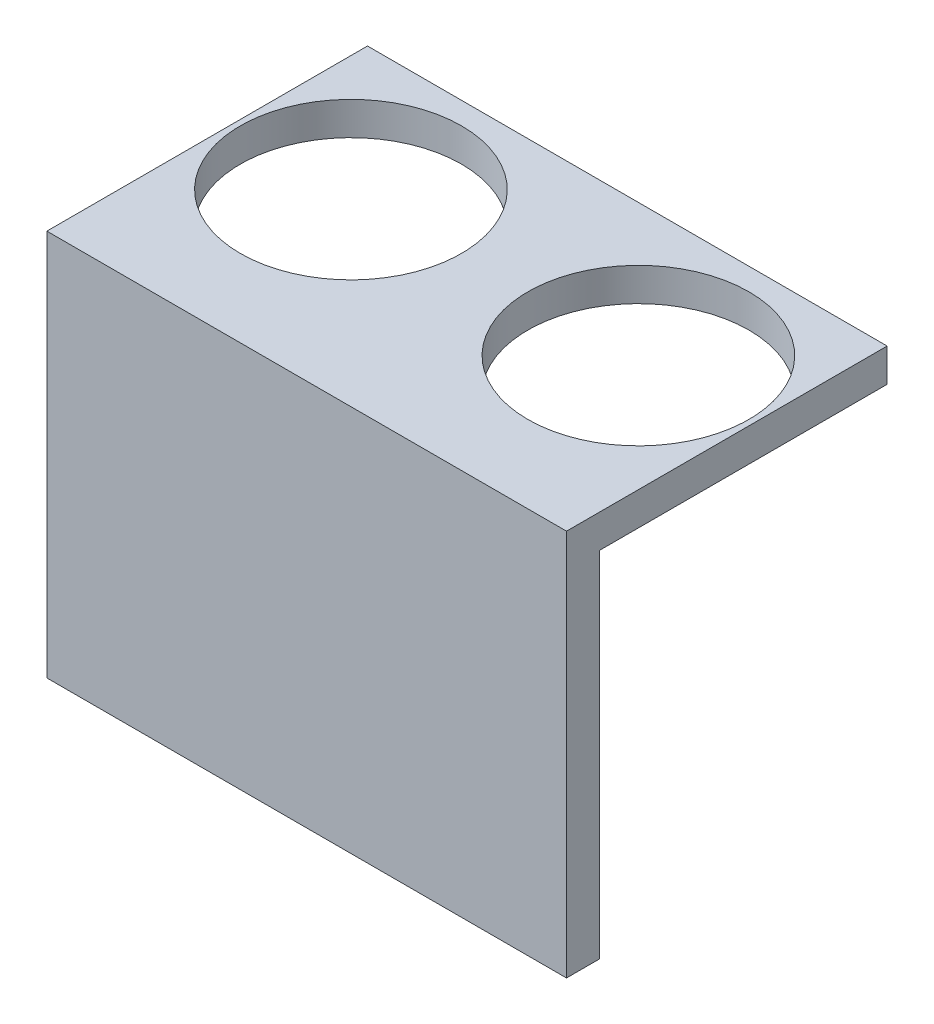
ISO-10303-21;
HEADER;
FILE_DESCRIPTION(('STEP AP214'),'2;1');
FILE_NAME('part.step','',(''),(''),'','','');
FILE_SCHEMA(('AUTOMOTIVE_DESIGN { 1 0 10303 214 1 1 1 1 }'));
ENDSEC;
DATA;
#1=APPLICATION_CONTEXT('core data for automotive mechanical design processes');
#2=APPLICATION_PROTOCOL_DEFINITION('international standard','automotive_design',2000,#1);
#3=PRODUCT_CONTEXT('',#1,'mechanical');
#4=PRODUCT('Part','Part','',(#3));
#5=PRODUCT_RELATED_PRODUCT_CATEGORY('part','',(#4));
#6=PRODUCT_DEFINITION_FORMATION('','',#4);
#7=PRODUCT_DEFINITION_CONTEXT('part definition',#1,'design');
#8=PRODUCT_DEFINITION('design','',#6,#7);
#9=PRODUCT_DEFINITION_SHAPE('','',#8);
#10=(LENGTH_UNIT() NAMED_UNIT(*) SI_UNIT(.MILLI.,.METRE.));
#11=(NAMED_UNIT(*) PLANE_ANGLE_UNIT() SI_UNIT($,.RADIAN.));
#12=(NAMED_UNIT(*) SI_UNIT($,.STERADIAN.) SOLID_ANGLE_UNIT());
#13=UNCERTAINTY_MEASURE_WITH_UNIT(LENGTH_MEASURE(1.E-05),#10,'distance_accuracy_value','');
#14=(GEOMETRIC_REPRESENTATION_CONTEXT(3) GLOBAL_UNCERTAINTY_ASSIGNED_CONTEXT((#13)) GLOBAL_UNIT_ASSIGNED_CONTEXT((#10,
#11,#12)) REPRESENTATION_CONTEXT('',''));
#15=CARTESIAN_POINT('',(0.,0.,0.));
#16=DIRECTION('',(0.,0.,1.));
#17=DIRECTION('',(1.,0.,0.));
#18=AXIS2_PLACEMENT_3D('',#15,#16,#17);
#19=CARTESIAN_POINT('',(0.,3.,-12.));
#20=DIRECTION('',(0.,0.,-1.));
#21=DIRECTION('',(-1.,0.,0.));
#22=AXIS2_PLACEMENT_3D('',#19,#20,#21);
#23=PLANE('',#22);
#24=DIRECTION('',(1.,0.,0.));
#25=VECTOR('',#24,1.);
#26=CARTESIAN_POINT('',(0.,0.,-12.));
#27=LINE('',#26,#25);
#28=CARTESIAN_POINT('',(-23.5,0.,-12.));
#29=VERTEX_POINT('',#28);
#30=CARTESIAN_POINT('',(23.5,0.,-12.));
#31=VERTEX_POINT('',#30);
#32=EDGE_CURVE('E168',#29,#31,#27,.T.);
#33=ORIENTED_EDGE('',*,*,#32,.F.);
#34=DIRECTION('',(0.,-1.,0.));
#35=VECTOR('',#34,1.);
#36=CARTESIAN_POINT('',(-23.5,3.,-12.));
#37=LINE('',#36,#35);
#38=CARTESIAN_POINT('',(-23.5,3.,-12.));
#39=VERTEX_POINT('',#38);
#40=EDGE_CURVE('E11',#39,#29,#37,.T.);
#41=ORIENTED_EDGE('',*,*,#40,.F.);
#42=DIRECTION('',(1.,0.,0.));
#43=VECTOR('',#42,1.);
#44=CARTESIAN_POINT('',(0.,3.,-12.));
#45=LINE('',#44,#43);
#46=CARTESIAN_POINT('',(23.5,3.,-12.));
#47=VERTEX_POINT('',#46);
#48=EDGE_CURVE('E151',#39,#47,#45,.T.);
#49=ORIENTED_EDGE('',*,*,#48,.T.);
#50=DIRECTION('',(0.,-1.,0.));
#51=VECTOR('',#50,1.);
#52=CARTESIAN_POINT('',(23.5,3.,-12.));
#53=LINE('',#52,#51);
#54=EDGE_CURVE('E51',#47,#31,#53,.T.);
#55=ORIENTED_EDGE('',*,*,#54,.T.);
#56=EDGE_LOOP('',(#33,#41,#49,#55));
#57=FACE_BOUND('',#56,.T.);
#58=ADVANCED_FACE('F41',(#57),#23,.T.);
#59=CARTESIAN_POINT('',(-23.5,3.,0.));
#60=DIRECTION('',(-1.,0.,0.));
#61=DIRECTION('',(0.,0.,1.));
#62=AXIS2_PLACEMENT_3D('',#59,#60,#61);
#63=PLANE('',#62);
#64=DIRECTION('',(0.,0.,-1.));
#65=VECTOR('',#64,1.);
#66=CARTESIAN_POINT('',(-23.5,0.,0.));
#67=LINE('',#66,#65);
#68=CARTESIAN_POINT('',(-23.5,0.,14.));
#69=VERTEX_POINT('',#68);
#70=EDGE_CURVE('E74',#69,#29,#67,.T.);
#71=ORIENTED_EDGE('',*,*,#70,.F.);
#72=DIRECTION('',(0.,1.,0.));
#73=VECTOR('',#72,1.);
#74=CARTESIAN_POINT('',(-23.5,-32.,14.));
#75=LINE('',#74,#73);
#76=CARTESIAN_POINT('',(-23.5,-32.,14.));
#77=VERTEX_POINT('',#76);
#78=EDGE_CURVE('E137',#77,#69,#75,.T.);
#79=ORIENTED_EDGE('',*,*,#78,.F.);
#80=DIRECTION('',(0.,0.,1.));
#81=VECTOR('',#80,1.);
#82=CARTESIAN_POINT('',(-23.5,-32.,14.));
#83=LINE('',#82,#81);
#84=CARTESIAN_POINT('',(-23.5,-32.,17.));
#85=VERTEX_POINT('',#84);
#86=EDGE_CURVE('E119',#77,#85,#83,.T.);
#87=ORIENTED_EDGE('',*,*,#86,.T.);
#88=DIRECTION('',(0.,1.,0.));
#89=VECTOR('',#88,1.);
#90=CARTESIAN_POINT('',(-23.5,-32.,17.));
#91=LINE('',#90,#89);
#92=CARTESIAN_POINT('',(-23.5,3.,17.));
#93=VERTEX_POINT('',#92);
#94=EDGE_CURVE('E123',#85,#93,#91,.T.);
#95=ORIENTED_EDGE('',*,*,#94,.T.);
#96=DIRECTION('',(0.,0.,-1.));
#97=VECTOR('',#96,1.);
#98=CARTESIAN_POINT('',(-23.5,3.,0.));
#99=LINE('',#98,#97);
#100=EDGE_CURVE('E156',#93,#39,#99,.T.);
#101=ORIENTED_EDGE('',*,*,#100,.T.);
#102=ORIENTED_EDGE('',*,*,#40,.T.);
#103=EDGE_LOOP('',(#71,#79,#87,#95,#101,#102));
#104=FACE_BOUND('',#103,.T.);
#105=ADVANCED_FACE('F186',(#104),#63,.T.);
#106=CARTESIAN_POINT('',(23.5,3.,0.));
#107=DIRECTION('',(-1.,0.,0.));
#108=DIRECTION('',(0.,0.,1.));
#109=AXIS2_PLACEMENT_3D('',#106,#107,#108);
#110=PLANE('',#109);
#111=DIRECTION('',(0.,0.,-1.));
#112=VECTOR('',#111,1.);
#113=CARTESIAN_POINT('',(23.5,0.,0.));
#114=LINE('',#113,#112);
#115=CARTESIAN_POINT('',(23.5,0.,14.));
#116=VERTEX_POINT('',#115);
#117=EDGE_CURVE('E174',#116,#31,#114,.T.);
#118=ORIENTED_EDGE('',*,*,#117,.T.);
#119=ORIENTED_EDGE('',*,*,#54,.F.);
#120=DIRECTION('',(0.,0.,-1.));
#121=VECTOR('',#120,1.);
#122=CARTESIAN_POINT('',(23.5,3.,0.));
#123=LINE('',#122,#121);
#124=CARTESIAN_POINT('',(23.5,3.,17.));
#125=VERTEX_POINT('',#124);
#126=EDGE_CURVE('E59',#125,#47,#123,.T.);
#127=ORIENTED_EDGE('',*,*,#126,.F.);
#128=DIRECTION('',(0.,1.,0.));
#129=VECTOR('',#128,1.);
#130=CARTESIAN_POINT('',(23.5,-32.,17.));
#131=LINE('',#130,#129);
#132=CARTESIAN_POINT('',(23.5,-32.,17.));
#133=VERTEX_POINT('',#132);
#134=EDGE_CURVE('E112',#133,#125,#131,.T.);
#135=ORIENTED_EDGE('',*,*,#134,.F.);
#136=DIRECTION('',(0.,0.,1.));
#137=VECTOR('',#136,1.);
#138=CARTESIAN_POINT('',(23.5,-32.,14.));
#139=LINE('',#138,#137);
#140=CARTESIAN_POINT('',(23.5,-32.,14.));
#141=VERTEX_POINT('',#140);
#142=EDGE_CURVE('E97',#141,#133,#139,.T.);
#143=ORIENTED_EDGE('',*,*,#142,.F.);
#144=DIRECTION('',(0.,1.,0.));
#145=VECTOR('',#144,1.);
#146=CARTESIAN_POINT('',(23.5,-32.,14.));
#147=LINE('',#146,#145);
#148=EDGE_CURVE('E118',#141,#116,#147,.T.);
#149=ORIENTED_EDGE('',*,*,#148,.T.);
#150=EDGE_LOOP('',(#118,#119,#127,#135,#143,#149));
#151=FACE_BOUND('',#150,.T.);
#152=ADVANCED_FACE('F114',(#151),#110,.F.);
#153=CARTESIAN_POINT('',(-13.,3.,0.));
#154=DIRECTION('',(0.,-1.,0.));
#155=DIRECTION('',(0.,0.,-1.));
#156=AXIS2_PLACEMENT_3D('',#153,#154,#155);
#157=CYLINDRICAL_SURFACE('',#156,10.);
#158=CARTESIAN_POINT('',(-13.,3.,0.));
#159=DIRECTION('',(0.,1.,0.));
#160=DIRECTION('',(0.,0.,1.));
#161=AXIS2_PLACEMENT_3D('',#158,#159,#160);
#162=CIRCLE('',#161,10.);
#163=CARTESIAN_POINT('',(-13.,3.,10.));
#164=VERTEX_POINT('',#163);
#165=EDGE_CURVE('E147',#164,#164,#162,.T.);
#166=ORIENTED_EDGE('',*,*,#165,.T.);
#167=EDGE_LOOP('',(#166));
#168=FACE_BOUND('',#167,.T.);
#169=CARTESIAN_POINT('',(-13.,0.,0.));
#170=DIRECTION('',(0.,1.,0.));
#171=DIRECTION('',(0.,0.,1.));
#172=AXIS2_PLACEMENT_3D('',#169,#170,#171);
#173=CIRCLE('',#172,10.);
#174=CARTESIAN_POINT('',(-13.,0.,10.));
#175=VERTEX_POINT('',#174);
#176=EDGE_CURVE('E146',#175,#175,#173,.T.);
#177=ORIENTED_EDGE('',*,*,#176,.F.);
#178=EDGE_LOOP('',(#177));
#179=FACE_BOUND('',#178,.T.);
#180=ADVANCED_FACE('F43',(#168,#179),#157,.F.);
#181=CARTESIAN_POINT('',(13.,3.,0.));
#182=DIRECTION('',(0.,-1.,0.));
#183=DIRECTION('',(0.,0.,-1.));
#184=AXIS2_PLACEMENT_3D('',#181,#182,#183);
#185=CYLINDRICAL_SURFACE('',#184,10.);
#186=CARTESIAN_POINT('',(13.,3.,0.));
#187=DIRECTION('',(0.,1.,0.));
#188=DIRECTION('',(0.,0.,1.));
#189=AXIS2_PLACEMENT_3D('',#186,#187,#188);
#190=CIRCLE('',#189,10.);
#191=CARTESIAN_POINT('',(13.,3.,10.));
#192=VERTEX_POINT('',#191);
#193=EDGE_CURVE('E161',#192,#192,#190,.T.);
#194=ORIENTED_EDGE('',*,*,#193,.T.);
#195=EDGE_LOOP('',(#194));
#196=FACE_BOUND('',#195,.T.);
#197=CARTESIAN_POINT('',(13.,0.,0.));
#198=DIRECTION('',(0.,1.,0.));
#199=DIRECTION('',(0.,0.,1.));
#200=AXIS2_PLACEMENT_3D('',#197,#198,#199);
#201=CIRCLE('',#200,10.);
#202=CARTESIAN_POINT('',(13.,0.,10.));
#203=VERTEX_POINT('',#202);
#204=EDGE_CURVE('E152',#203,#203,#201,.T.);
#205=ORIENTED_EDGE('',*,*,#204,.F.);
#206=EDGE_LOOP('',(#205));
#207=FACE_BOUND('',#206,.T.);
#208=ADVANCED_FACE('F190',(#196,#207),#185,.F.);
#209=CARTESIAN_POINT('',(0.,3.,0.));
#210=DIRECTION('',(0.,1.,0.));
#211=DIRECTION('',(0.,0.,1.));
#212=AXIS2_PLACEMENT_3D('',#209,#210,#211);
#213=PLANE('',#212);
#214=ORIENTED_EDGE('',*,*,#165,.F.);
#215=EDGE_LOOP('',(#214));
#216=FACE_BOUND('',#215,.T.);
#217=ORIENTED_EDGE('',*,*,#48,.F.);
#218=ORIENTED_EDGE('',*,*,#100,.F.);
#219=DIRECTION('',(1.,0.,0.));
#220=VECTOR('',#219,1.);
#221=CARTESIAN_POINT('',(-23.5,3.,17.));
#222=LINE('',#221,#220);
#223=EDGE_CURVE('E125',#93,#125,#222,.T.);
#224=ORIENTED_EDGE('',*,*,#223,.T.);
#225=ORIENTED_EDGE('',*,*,#126,.T.);
#226=EDGE_LOOP('',(#217,#218,#224,#225));
#227=FACE_BOUND('',#226,.T.);
#228=ORIENTED_EDGE('',*,*,#193,.F.);
#229=EDGE_LOOP('',(#228));
#230=FACE_BOUND('',#229,.T.);
#231=ADVANCED_FACE('F187',(#216,#227,#230),#213,.T.);
#232=CARTESIAN_POINT('',(0.,0.,0.));
#233=DIRECTION('',(0.,1.,0.));
#234=DIRECTION('',(0.,0.,1.));
#235=AXIS2_PLACEMENT_3D('',#232,#233,#234);
#236=PLANE('',#235);
#237=ORIENTED_EDGE('',*,*,#176,.T.);
#238=EDGE_LOOP('',(#237));
#239=FACE_BOUND('',#238,.T.);
#240=ORIENTED_EDGE('',*,*,#32,.T.);
#241=ORIENTED_EDGE('',*,*,#117,.F.);
#242=DIRECTION('',(1.,0.,0.));
#243=VECTOR('',#242,1.);
#244=CARTESIAN_POINT('',(-23.5,0.,14.));
#245=LINE('',#244,#243);
#246=EDGE_CURVE('E136',#69,#116,#245,.T.);
#247=ORIENTED_EDGE('',*,*,#246,.F.);
#248=ORIENTED_EDGE('',*,*,#70,.T.);
#249=EDGE_LOOP('',(#240,#241,#247,#248));
#250=FACE_BOUND('',#249,.T.);
#251=ORIENTED_EDGE('',*,*,#204,.T.);
#252=EDGE_LOOP('',(#251));
#253=FACE_BOUND('',#252,.T.);
#254=ADVANCED_FACE('F182',(#239,#250,#253),#236,.F.);
#255=CARTESIAN_POINT('',(-23.5,-32.,14.));
#256=DIRECTION('',(0.,0.,1.));
#257=DIRECTION('',(1.,0.,0.));
#258=AXIS2_PLACEMENT_3D('',#255,#256,#257);
#259=PLANE('',#258);
#260=ORIENTED_EDGE('',*,*,#78,.T.);
#261=ORIENTED_EDGE('',*,*,#246,.T.);
#262=ORIENTED_EDGE('',*,*,#148,.F.);
#263=DIRECTION('',(1.,0.,0.));
#264=VECTOR('',#263,1.);
#265=CARTESIAN_POINT('',(-23.5,-32.,14.));
#266=LINE('',#265,#264);
#267=EDGE_CURVE('E105',#77,#141,#266,.T.);
#268=ORIENTED_EDGE('',*,*,#267,.F.);
#269=EDGE_LOOP('',(#260,#261,#262,#268));
#270=FACE_BOUND('',#269,.T.);
#271=ADVANCED_FACE('F185',(#270),#259,.F.);
#272=CARTESIAN_POINT('',(-23.5,-32.,17.));
#273=DIRECTION('',(0.,0.,1.));
#274=DIRECTION('',(1.,0.,0.));
#275=AXIS2_PLACEMENT_3D('',#272,#273,#274);
#276=PLANE('',#275);
#277=ORIENTED_EDGE('',*,*,#223,.F.);
#278=ORIENTED_EDGE('',*,*,#94,.F.);
#279=DIRECTION('',(1.,0.,0.));
#280=VECTOR('',#279,1.);
#281=CARTESIAN_POINT('',(-23.5,-32.,17.));
#282=LINE('',#281,#280);
#283=EDGE_CURVE('E102',#85,#133,#282,.T.);
#284=ORIENTED_EDGE('',*,*,#283,.T.);
#285=ORIENTED_EDGE('',*,*,#134,.T.);
#286=EDGE_LOOP('',(#277,#278,#284,#285));
#287=FACE_BOUND('',#286,.T.);
#288=ADVANCED_FACE('F121',(#287),#276,.T.);
#289=CARTESIAN_POINT('',(0.,-32.,0.));
#290=DIRECTION('',(0.,-1.,0.));
#291=DIRECTION('',(0.,0.,-1.));
#292=AXIS2_PLACEMENT_3D('',#289,#290,#291);
#293=PLANE('',#292);
#294=ORIENTED_EDGE('',*,*,#283,.F.);
#295=ORIENTED_EDGE('',*,*,#86,.F.);
#296=ORIENTED_EDGE('',*,*,#267,.T.);
#297=ORIENTED_EDGE('',*,*,#142,.T.);
#298=EDGE_LOOP('',(#294,#295,#296,#297));
#299=FACE_BOUND('',#298,.T.);
#300=ADVANCED_FACE('F99',(#299),#293,.T.);
#301=CLOSED_SHELL('',(#58,#105,#152,#180,#208,#231,#254,#271,#288,#300));
#302=MANIFOLD_SOLID_BREP('B2',#301);
#303=ADVANCED_BREP_SHAPE_REPRESENTATION('',(#18,#302),#14);
#304=SHAPE_DEFINITION_REPRESENTATION(#9,#303);
ENDSEC;
END-ISO-10303-21;
